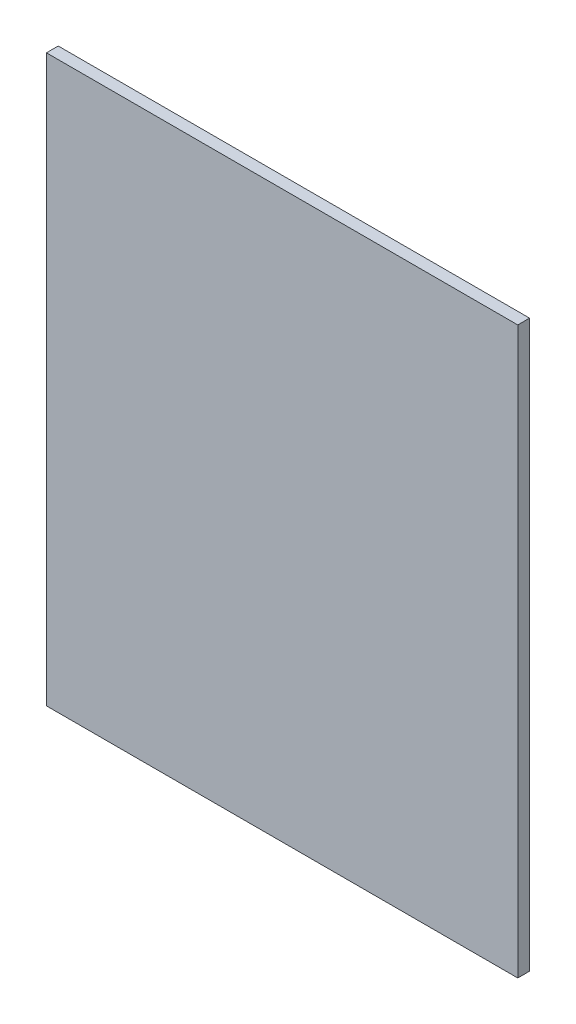
ISO-10303-21;
HEADER;
FILE_DESCRIPTION(('STEP AP214'),'2;1');
FILE_NAME('part.step','',(''),(''),'','','');
FILE_SCHEMA(('AUTOMOTIVE_DESIGN { 1 0 10303 214 1 1 1 1 }'));
ENDSEC;
DATA;
#1=APPLICATION_CONTEXT('core data for automotive mechanical design processes');
#2=APPLICATION_PROTOCOL_DEFINITION('international standard','automotive_design',2000,#1);
#3=PRODUCT_CONTEXT('',#1,'mechanical');
#4=PRODUCT('Part','Part','',(#3));
#5=PRODUCT_RELATED_PRODUCT_CATEGORY('part','',(#4));
#6=PRODUCT_DEFINITION_FORMATION('','',#4);
#7=PRODUCT_DEFINITION_CONTEXT('part definition',#1,'design');
#8=PRODUCT_DEFINITION('design','',#6,#7);
#9=PRODUCT_DEFINITION_SHAPE('','',#8);
#10=(LENGTH_UNIT() NAMED_UNIT(*) SI_UNIT(.MILLI.,.METRE.));
#11=(NAMED_UNIT(*) PLANE_ANGLE_UNIT() SI_UNIT($,.RADIAN.));
#12=(NAMED_UNIT(*) SI_UNIT($,.STERADIAN.) SOLID_ANGLE_UNIT());
#13=UNCERTAINTY_MEASURE_WITH_UNIT(LENGTH_MEASURE(1.E-05),#10,'distance_accuracy_value','');
#14=(GEOMETRIC_REPRESENTATION_CONTEXT(3) GLOBAL_UNCERTAINTY_ASSIGNED_CONTEXT((#13)) GLOBAL_UNIT_ASSIGNED_CONTEXT((#10,
#11,#12)) REPRESENTATION_CONTEXT('',''));
#15=CARTESIAN_POINT('',(0.,0.,0.));
#16=DIRECTION('',(0.,0.,1.));
#17=DIRECTION('',(1.,0.,0.));
#18=AXIS2_PLACEMENT_3D('',#15,#16,#17);
#19=CARTESIAN_POINT('',(-59.631783104976,1065.63469322759,10.0000000000002));
#20=DIRECTION('',(1.,0.,0.));
#21=DIRECTION('',(0.,-1.,0.));
#22=AXIS2_PLACEMENT_3D('',#19,#20,#21);
#23=PLANE('',#22);
#24=DIRECTION('',(0.,1.,0.));
#25=VECTOR('',#24,1.);
#26=CARTESIAN_POINT('',(-59.631783104976,1065.63469322759,2.37782925852001E-13));
#27=LINE('',#26,#25);
#28=CARTESIAN_POINT('',(-59.631783104976,1065.63469322759,2.37782925852001E-13));
#29=VERTEX_POINT('',#28);
#30=CARTESIAN_POINT('',(-59.6317831049759,1545.63469322759,4.59153863203816E-13));
#31=VERTEX_POINT('',#30);
#32=EDGE_CURVE('E95',#29,#31,#27,.T.);
#33=ORIENTED_EDGE('',*,*,#32,.F.);
#34=DIRECTION('',(0.,0.,-1.));
#35=VECTOR('',#34,1.);
#36=CARTESIAN_POINT('',(-59.631783104976,1065.63469322759,10.0000000000002));
#37=LINE('',#36,#35);
#38=CARTESIAN_POINT('',(-59.631783104976,1065.63469322759,10.0000000000002));
#39=VERTEX_POINT('',#38);
#40=EDGE_CURVE('E94',#39,#29,#37,.T.);
#41=ORIENTED_EDGE('',*,*,#40,.F.);
#42=DIRECTION('',(0.,1.,0.));
#43=VECTOR('',#42,1.);
#44=CARTESIAN_POINT('',(-59.631783104976,1065.63469322759,10.0000000000002));
#45=LINE('',#44,#43);
#46=CARTESIAN_POINT('',(-59.6317831049759,1545.63469322759,10.0000000000005));
#47=VERTEX_POINT('',#46);
#48=EDGE_CURVE('E89',#39,#47,#45,.T.);
#49=ORIENTED_EDGE('',*,*,#48,.T.);
#50=DIRECTION('',(0.,0.,-1.));
#51=VECTOR('',#50,1.);
#52=CARTESIAN_POINT('',(-59.6317831049759,1545.63469322759,10.0000000000005));
#53=LINE('',#52,#51);
#54=EDGE_CURVE('E11',#47,#31,#53,.T.);
#55=ORIENTED_EDGE('',*,*,#54,.T.);
#56=EDGE_LOOP('',(#33,#41,#49,#55));
#57=FACE_BOUND('',#56,.T.);
#58=ADVANCED_FACE('F32',(#57),#23,.F.);
#59=CARTESIAN_POINT('',(-59.6317831049759,1545.63469322759,10.0000000000005));
#60=DIRECTION('',(0.,-1.,0.));
#61=DIRECTION('',(0.,0.,1.));
#62=AXIS2_PLACEMENT_3D('',#59,#60,#61);
#63=PLANE('',#62);
#64=DIRECTION('',(1.,0.,0.));
#65=VECTOR('',#64,1.);
#66=CARTESIAN_POINT('',(-59.6317831049759,1545.63469322759,4.59153863203816E-13));
#67=LINE('',#66,#65);
#68=CARTESIAN_POINT('',(340.368216895024,1545.63469322759,4.59153863203816E-13));
#69=VERTEX_POINT('',#68);
#70=EDGE_CURVE('E97',#31,#69,#67,.T.);
#71=ORIENTED_EDGE('',*,*,#70,.F.);
#72=ORIENTED_EDGE('',*,*,#54,.F.);
#73=DIRECTION('',(1.,0.,0.));
#74=VECTOR('',#73,1.);
#75=CARTESIAN_POINT('',(-59.6317831049759,1545.63469322759,10.0000000000005));
#76=LINE('',#75,#74);
#77=CARTESIAN_POINT('',(340.368216895024,1545.63469322759,10.0000000000005));
#78=VERTEX_POINT('',#77);
#79=EDGE_CURVE('E73',#47,#78,#76,.T.);
#80=ORIENTED_EDGE('',*,*,#79,.T.);
#81=DIRECTION('',(0.,0.,-1.));
#82=VECTOR('',#81,1.);
#83=CARTESIAN_POINT('',(340.368216895024,1545.63469322759,10.0000000000005));
#84=LINE('',#83,#82);
#85=EDGE_CURVE('E40',#78,#69,#84,.T.);
#86=ORIENTED_EDGE('',*,*,#85,.T.);
#87=EDGE_LOOP('',(#71,#72,#80,#86));
#88=FACE_BOUND('',#87,.T.);
#89=ADVANCED_FACE('F87',(#88),#63,.F.);
#90=CARTESIAN_POINT('',(340.368216895024,1065.63469322759,10.0000000000002));
#91=DIRECTION('',(-1.,0.,0.));
#92=DIRECTION('',(0.,1.,0.));
#93=AXIS2_PLACEMENT_3D('',#90,#91,#92);
#94=PLANE('',#93);
#95=DIRECTION('',(0.,-1.,0.));
#96=VECTOR('',#95,1.);
#97=CARTESIAN_POINT('',(340.368216895024,1065.63469322759,2.37782925852001E-13));
#98=LINE('',#97,#96);
#99=CARTESIAN_POINT('',(340.368216895024,1065.63469322759,2.37782925852001E-13));
#100=VERTEX_POINT('',#99);
#101=EDGE_CURVE('E83',#69,#100,#98,.T.);
#102=ORIENTED_EDGE('',*,*,#101,.F.);
#103=ORIENTED_EDGE('',*,*,#85,.F.);
#104=DIRECTION('',(0.,-1.,0.));
#105=VECTOR('',#104,1.);
#106=CARTESIAN_POINT('',(340.368216895024,1065.63469322759,10.0000000000002));
#107=LINE('',#106,#105);
#108=CARTESIAN_POINT('',(340.368216895024,1065.63469322759,10.0000000000002));
#109=VERTEX_POINT('',#108);
#110=EDGE_CURVE('E76',#78,#109,#107,.T.);
#111=ORIENTED_EDGE('',*,*,#110,.T.);
#112=DIRECTION('',(0.,0.,-1.));
#113=VECTOR('',#112,1.);
#114=CARTESIAN_POINT('',(340.368216895024,1065.63469322759,10.0000000000002));
#115=LINE('',#114,#113);
#116=EDGE_CURVE('E86',#109,#100,#115,.T.);
#117=ORIENTED_EDGE('',*,*,#116,.T.);
#118=EDGE_LOOP('',(#102,#103,#111,#117));
#119=FACE_BOUND('',#118,.T.);
#120=ADVANCED_FACE('F82',(#119),#94,.F.);
#121=CARTESIAN_POINT('',(-59.631783104976,1065.63469322759,10.0000000000002));
#122=DIRECTION('',(0.,1.,0.));
#123=DIRECTION('',(0.,0.,-1.));
#124=AXIS2_PLACEMENT_3D('',#121,#122,#123);
#125=PLANE('',#124);
#126=DIRECTION('',(-1.,0.,0.));
#127=VECTOR('',#126,1.);
#128=CARTESIAN_POINT('',(-59.631783104976,1065.63469322759,2.37782925852001E-13));
#129=LINE('',#128,#127);
#130=EDGE_CURVE('E62',#100,#29,#129,.T.);
#131=ORIENTED_EDGE('',*,*,#130,.F.);
#132=ORIENTED_EDGE('',*,*,#116,.F.);
#133=DIRECTION('',(-1.,0.,0.));
#134=VECTOR('',#133,1.);
#135=CARTESIAN_POINT('',(-59.631783104976,1065.63469322759,10.0000000000002));
#136=LINE('',#135,#134);
#137=EDGE_CURVE('E48',#109,#39,#136,.T.);
#138=ORIENTED_EDGE('',*,*,#137,.T.);
#139=ORIENTED_EDGE('',*,*,#40,.T.);
#140=EDGE_LOOP('',(#131,#132,#138,#139));
#141=FACE_BOUND('',#140,.T.);
#142=ADVANCED_FACE('F106',(#141),#125,.F.);
#143=CARTESIAN_POINT('',(-59.6317831049759,1545.63469322759,10.0000000000005));
#144=DIRECTION('',(0.,0.,1.));
#145=DIRECTION('',(1.,0.,0.));
#146=AXIS2_PLACEMENT_3D('',#143,#144,#145);
#147=PLANE('',#146);
#148=ORIENTED_EDGE('',*,*,#48,.F.);
#149=ORIENTED_EDGE('',*,*,#137,.F.);
#150=ORIENTED_EDGE('',*,*,#110,.F.);
#151=ORIENTED_EDGE('',*,*,#79,.F.);
#152=EDGE_LOOP('',(#148,#149,#150,#151));
#153=FACE_BOUND('',#152,.T.);
#154=ADVANCED_FACE('F78',(#153),#147,.T.);
#155=CARTESIAN_POINT('',(-59.6317831049759,1545.63469322759,4.59153863203816E-13));
#156=DIRECTION('',(0.,0.,1.));
#157=DIRECTION('',(1.,0.,0.));
#158=AXIS2_PLACEMENT_3D('',#155,#156,#157);
#159=PLANE('',#158);
#160=ORIENTED_EDGE('',*,*,#32,.T.);
#161=ORIENTED_EDGE('',*,*,#70,.T.);
#162=ORIENTED_EDGE('',*,*,#101,.T.);
#163=ORIENTED_EDGE('',*,*,#130,.T.);
#164=EDGE_LOOP('',(#160,#161,#162,#163));
#165=FACE_BOUND('',#164,.T.);
#166=ADVANCED_FACE('F102',(#165),#159,.F.);
#167=CLOSED_SHELL('',(#58,#89,#120,#142,#154,#166));
#168=MANIFOLD_SOLID_BREP('B2',#167);
#169=ADVANCED_BREP_SHAPE_REPRESENTATION('',(#18,#168),#14);
#170=SHAPE_DEFINITION_REPRESENTATION(#9,#169);
ENDSEC;
END-ISO-10303-21;
